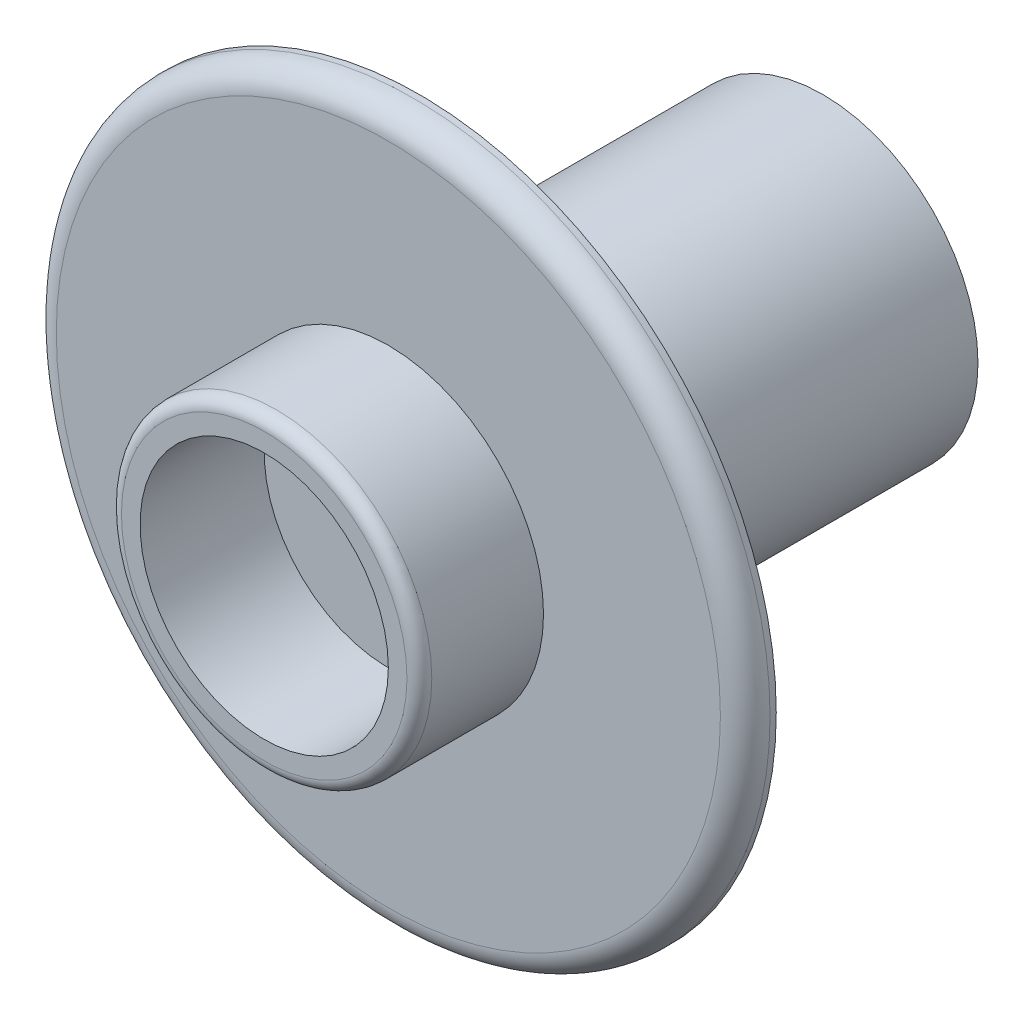
ISO-10303-21;
HEADER;
FILE_DESCRIPTION(('STEP AP214'),'2;1');
FILE_NAME('part.step','',(''),(''),'','','');
FILE_SCHEMA(('AUTOMOTIVE_DESIGN { 1 0 10303 214 1 1 1 1 }'));
ENDSEC;
DATA;
#1=APPLICATION_CONTEXT('core data for automotive mechanical design processes');
#2=APPLICATION_PROTOCOL_DEFINITION('international standard','automotive_design',2000,#1);
#3=PRODUCT_CONTEXT('',#1,'mechanical');
#4=PRODUCT('Part','Part','',(#3));
#5=PRODUCT_RELATED_PRODUCT_CATEGORY('part','',(#4));
#6=PRODUCT_DEFINITION_FORMATION('','',#4);
#7=PRODUCT_DEFINITION_CONTEXT('part definition',#1,'design');
#8=PRODUCT_DEFINITION('design','',#6,#7);
#9=PRODUCT_DEFINITION_SHAPE('','',#8);
#10=(LENGTH_UNIT() NAMED_UNIT(*) SI_UNIT(.MILLI.,.METRE.));
#11=(NAMED_UNIT(*) PLANE_ANGLE_UNIT() SI_UNIT($,.RADIAN.));
#12=(NAMED_UNIT(*) SI_UNIT($,.STERADIAN.) SOLID_ANGLE_UNIT());
#13=UNCERTAINTY_MEASURE_WITH_UNIT(LENGTH_MEASURE(1.E-05),#10,'distance_accuracy_value','');
#14=(GEOMETRIC_REPRESENTATION_CONTEXT(3) GLOBAL_UNCERTAINTY_ASSIGNED_CONTEXT((#13)) GLOBAL_UNIT_ASSIGNED_CONTEXT((#10,
#11,#12)) REPRESENTATION_CONTEXT('',''));
#15=CARTESIAN_POINT('',(0.,0.,0.));
#16=DIRECTION('',(0.,0.,1.));
#17=DIRECTION('',(1.,0.,0.));
#18=AXIS2_PLACEMENT_3D('',#15,#16,#17);
#19=CARTESIAN_POINT('',(0.,0.,3.175));
#20=DIRECTION('',(0.,0.,-1.));
#21=DIRECTION('',(-1.,0.,0.));
#22=AXIS2_PLACEMENT_3D('',#19,#20,#21);
#23=CYLINDRICAL_SURFACE('',#22,36.5125);
#24=CARTESIAN_POINT('',(0.,0.,0.635));
#25=DIRECTION('',(0.,0.,1.));
#26=DIRECTION('',(1.,0.,0.));
#27=AXIS2_PLACEMENT_3D('',#24,#25,#26);
#28=CIRCLE('',#27,36.5125);
#29=CARTESIAN_POINT('',(36.5125,0.,0.635));
#30=VERTEX_POINT('',#29);
#31=EDGE_CURVE('E59',#30,#30,#28,.F.);
#32=ORIENTED_EDGE('',*,*,#31,.T.);
#33=EDGE_LOOP('',(#32));
#34=FACE_BOUND('',#33,.T.);
#35=CARTESIAN_POINT('',(0.,0.,0.));
#36=DIRECTION('',(0.,0.,1.));
#37=DIRECTION('',(1.,0.,0.));
#38=AXIS2_PLACEMENT_3D('',#35,#36,#37);
#39=CIRCLE('',#38,36.5125);
#40=CARTESIAN_POINT('',(36.5125,0.,0.));
#41=VERTEX_POINT('',#40);
#42=EDGE_CURVE('E69',#41,#41,#39,.T.);
#43=ORIENTED_EDGE('',*,*,#42,.T.);
#44=EDGE_LOOP('',(#43));
#45=FACE_BOUND('',#44,.T.);
#46=ADVANCED_FACE('F48',(#34,#45),#23,.T.);
#47=CARTESIAN_POINT('',(0.,0.,3.175));
#48=DIRECTION('',(0.,0.,1.));
#49=DIRECTION('',(1.,0.,0.));
#50=AXIS2_PLACEMENT_3D('',#47,#48,#49);
#51=PLANE('',#50);
#52=CARTESIAN_POINT('',(0.,0.,3.175));
#53=DIRECTION('',(0.,0.,1.));
#54=DIRECTION('',(1.,0.,0.));
#55=AXIS2_PLACEMENT_3D('',#52,#53,#54);
#56=CIRCLE('',#55,33.9725);
#57=CARTESIAN_POINT('',(33.9725,0.,3.175));
#58=VERTEX_POINT('',#57);
#59=EDGE_CURVE('E63',#58,#58,#56,.T.);
#60=ORIENTED_EDGE('',*,*,#59,.T.);
#61=EDGE_LOOP('',(#60));
#62=FACE_BOUND('',#61,.T.);
#63=CARTESIAN_POINT('',(0.,0.,3.175));
#64=DIRECTION('',(0.,0.,1.));
#65=DIRECTION('',(1.,0.,0.));
#66=AXIS2_PLACEMENT_3D('',#63,#64,#65);
#67=CIRCLE('',#66,15.875);
#68=CARTESIAN_POINT('',(15.875,0.,3.175));
#69=VERTEX_POINT('',#68);
#70=EDGE_CURVE('E68',#69,#69,#67,.T.);
#71=ORIENTED_EDGE('',*,*,#70,.F.);
#72=EDGE_LOOP('',(#71));
#73=FACE_BOUND('',#72,.T.);
#74=ADVANCED_FACE('F105',(#62,#73),#51,.T.);
#75=CARTESIAN_POINT('',(0.,0.,0.));
#76=DIRECTION('',(0.,0.,1.));
#77=DIRECTION('',(1.,0.,0.));
#78=AXIS2_PLACEMENT_3D('',#75,#76,#77);
#79=PLANE('',#78);
#80=CARTESIAN_POINT('',(0.,0.,0.));
#81=DIRECTION('',(0.,0.,-1.));
#82=DIRECTION('',(-1.,0.,0.));
#83=AXIS2_PLACEMENT_3D('',#80,#81,#82);
#84=CIRCLE('',#83,15.875);
#85=CARTESIAN_POINT('',(-15.875,0.,0.));
#86=VERTEX_POINT('',#85);
#87=EDGE_CURVE('E72',#86,#86,#84,.T.);
#88=ORIENTED_EDGE('',*,*,#87,.F.);
#89=EDGE_LOOP('',(#88));
#90=FACE_BOUND('',#89,.T.);
#91=ORIENTED_EDGE('',*,*,#42,.F.);
#92=EDGE_LOOP('',(#91));
#93=FACE_BOUND('',#92,.T.);
#94=ADVANCED_FACE('F111',(#90,#93),#79,.F.);
#95=CARTESIAN_POINT('',(0.,0.,-41.275));
#96=DIRECTION('',(0.,0.,1.));
#97=DIRECTION('',(1.,0.,0.));
#98=AXIS2_PLACEMENT_3D('',#95,#96,#97);
#99=CYLINDRICAL_SURFACE('',#98,15.875);
#100=CARTESIAN_POINT('',(0.,0.,-41.275));
#101=DIRECTION('',(0.,0.,-1.));
#102=DIRECTION('',(-1.,0.,0.));
#103=AXIS2_PLACEMENT_3D('',#100,#101,#102);
#104=CIRCLE('',#103,15.875);
#105=CARTESIAN_POINT('',(-15.875,0.,-41.275));
#106=VERTEX_POINT('',#105);
#107=EDGE_CURVE('E73',#106,#106,#104,.T.);
#108=ORIENTED_EDGE('',*,*,#107,.F.);
#109=EDGE_LOOP('',(#108));
#110=FACE_BOUND('',#109,.T.);
#111=ORIENTED_EDGE('',*,*,#87,.T.);
#112=EDGE_LOOP('',(#111));
#113=FACE_BOUND('',#112,.T.);
#114=ADVANCED_FACE('F147',(#110,#113),#99,.T.);
#115=CARTESIAN_POINT('',(0.,0.,-41.275));
#116=DIRECTION('',(0.,0.,-1.));
#117=DIRECTION('',(-1.,0.,0.));
#118=AXIS2_PLACEMENT_3D('',#115,#116,#117);
#119=PLANE('',#118);
#120=ORIENTED_EDGE('',*,*,#107,.T.);
#121=EDGE_LOOP('',(#120));
#122=FACE_BOUND('',#121,.T.);
#123=ADVANCED_FACE('F102',(#122),#119,.T.);
#124=CARTESIAN_POINT('',(0.,0.,15.875));
#125=DIRECTION('',(0.,0.,-1.));
#126=DIRECTION('',(-1.,0.,0.));
#127=AXIS2_PLACEMENT_3D('',#124,#125,#126);
#128=CYLINDRICAL_SURFACE('',#127,15.875);
#129=CARTESIAN_POINT('',(0.,0.,14.605));
#130=DIRECTION('',(0.,0.,-1.));
#131=DIRECTION('',(-1.,0.,0.));
#132=AXIS2_PLACEMENT_3D('',#129,#130,#131);
#133=CIRCLE('',#132,15.875);
#134=CARTESIAN_POINT('',(-15.875,0.,14.605));
#135=VERTEX_POINT('',#134);
#136=EDGE_CURVE('E55',#135,#135,#133,.T.);
#137=ORIENTED_EDGE('',*,*,#136,.T.);
#138=EDGE_LOOP('',(#137));
#139=FACE_BOUND('',#138,.T.);
#140=ORIENTED_EDGE('',*,*,#70,.T.);
#141=EDGE_LOOP('',(#140));
#142=FACE_BOUND('',#141,.T.);
#143=ADVANCED_FACE('F97',(#139,#142),#128,.T.);
#144=CARTESIAN_POINT('',(0.,0.,15.875));
#145=DIRECTION('',(0.,0.,-1.));
#146=DIRECTION('',(-1.,0.,0.));
#147=AXIS2_PLACEMENT_3D('',#144,#145,#146);
#148=PLANE('',#147);
#149=CARTESIAN_POINT('',(0.,0.,15.875));
#150=DIRECTION('',(0.,0.,-1.));
#151=DIRECTION('',(-1.,0.,0.));
#152=AXIS2_PLACEMENT_3D('',#149,#150,#151);
#153=CIRCLE('',#152,14.605);
#154=CARTESIAN_POINT('',(-14.605,0.,15.875));
#155=VERTEX_POINT('',#154);
#156=EDGE_CURVE('E12',#155,#155,#153,.F.);
#157=ORIENTED_EDGE('',*,*,#156,.T.);
#158=EDGE_LOOP('',(#157));
#159=FACE_BOUND('',#158,.T.);
#160=CARTESIAN_POINT('',(0.,0.,15.875));
#161=DIRECTION('',(0.,0.,1.));
#162=DIRECTION('',(1.,0.,0.));
#163=AXIS2_PLACEMENT_3D('',#160,#161,#162);
#164=CIRCLE('',#163,12.7);
#165=CARTESIAN_POINT('',(12.7,0.,15.875));
#166=VERTEX_POINT('',#165);
#167=EDGE_CURVE('E81',#166,#166,#164,.T.);
#168=ORIENTED_EDGE('',*,*,#167,.F.);
#169=EDGE_LOOP('',(#168));
#170=FACE_BOUND('',#169,.T.);
#171=ADVANCED_FACE('F92',(#159,#170),#148,.F.);
#172=CARTESIAN_POINT('',(0.,0.,3.175));
#173=DIRECTION('',(0.,0.,1.));
#174=DIRECTION('',(1.,0.,0.));
#175=AXIS2_PLACEMENT_3D('',#172,#173,#174);
#176=CYLINDRICAL_SURFACE('',#175,12.7);
#177=CARTESIAN_POINT('',(0.,0.,3.175));
#178=DIRECTION('',(0.,0.,1.));
#179=DIRECTION('',(1.,0.,0.));
#180=AXIS2_PLACEMENT_3D('',#177,#178,#179);
#181=CIRCLE('',#180,12.7);
#182=CARTESIAN_POINT('',(12.7,0.,3.175));
#183=VERTEX_POINT('',#182);
#184=EDGE_CURVE('E78',#183,#183,#181,.T.);
#185=ORIENTED_EDGE('',*,*,#184,.F.);
#186=EDGE_LOOP('',(#185));
#187=FACE_BOUND('',#186,.T.);
#188=ORIENTED_EDGE('',*,*,#167,.T.);
#189=EDGE_LOOP('',(#188));
#190=FACE_BOUND('',#189,.T.);
#191=ADVANCED_FACE('F89',(#187,#190),#176,.F.);
#192=CARTESIAN_POINT('',(0.,0.,3.175));
#193=DIRECTION('',(0.,0.,1.));
#194=DIRECTION('',(1.,0.,0.));
#195=AXIS2_PLACEMENT_3D('',#192,#193,#194);
#196=PLANE('',#195);
#197=ORIENTED_EDGE('',*,*,#184,.T.);
#198=EDGE_LOOP('',(#197));
#199=FACE_BOUND('',#198,.T.);
#200=ADVANCED_FACE('F87',(#199),#196,.T.);
#201=CARTESIAN_POINT('',(0.,0.,0.635));
#202=DIRECTION('',(0.,0.,1.));
#203=DIRECTION('',(1.,0.,0.));
#204=AXIS2_PLACEMENT_3D('',#201,#202,#203);
#205=TOROIDAL_SURFACE('',#204,33.9725,2.54);
#206=ORIENTED_EDGE('',*,*,#31,.F.);
#207=EDGE_LOOP('',(#206));
#208=FACE_BOUND('',#207,.T.);
#209=ORIENTED_EDGE('',*,*,#59,.F.);
#210=EDGE_LOOP('',(#209));
#211=FACE_BOUND('',#210,.T.);
#212=ADVANCED_FACE('F116',(#208,#211),#205,.T.);
#213=CARTESIAN_POINT('',(0.,0.,14.605));
#214=DIRECTION('',(0.,0.,-1.));
#215=DIRECTION('',(-1.,0.,0.));
#216=AXIS2_PLACEMENT_3D('',#213,#214,#215);
#217=TOROIDAL_SURFACE('',#216,14.605,1.27);
#218=ORIENTED_EDGE('',*,*,#156,.F.);
#219=EDGE_LOOP('',(#218));
#220=FACE_BOUND('',#219,.T.);
#221=ORIENTED_EDGE('',*,*,#136,.F.);
#222=EDGE_LOOP('',(#221));
#223=FACE_BOUND('',#222,.T.);
#224=ADVANCED_FACE('F50',(#220,#223),#217,.T.);
#225=CLOSED_SHELL('',(#46,#74,#94,#114,#123,#143,#171,#191,#200,#212,#224));
#226=MANIFOLD_SOLID_BREP('B2',#225);
#227=ADVANCED_BREP_SHAPE_REPRESENTATION('',(#18,#226),#14);
#228=SHAPE_DEFINITION_REPRESENTATION(#9,#227);
ENDSEC;
END-ISO-10303-21;
